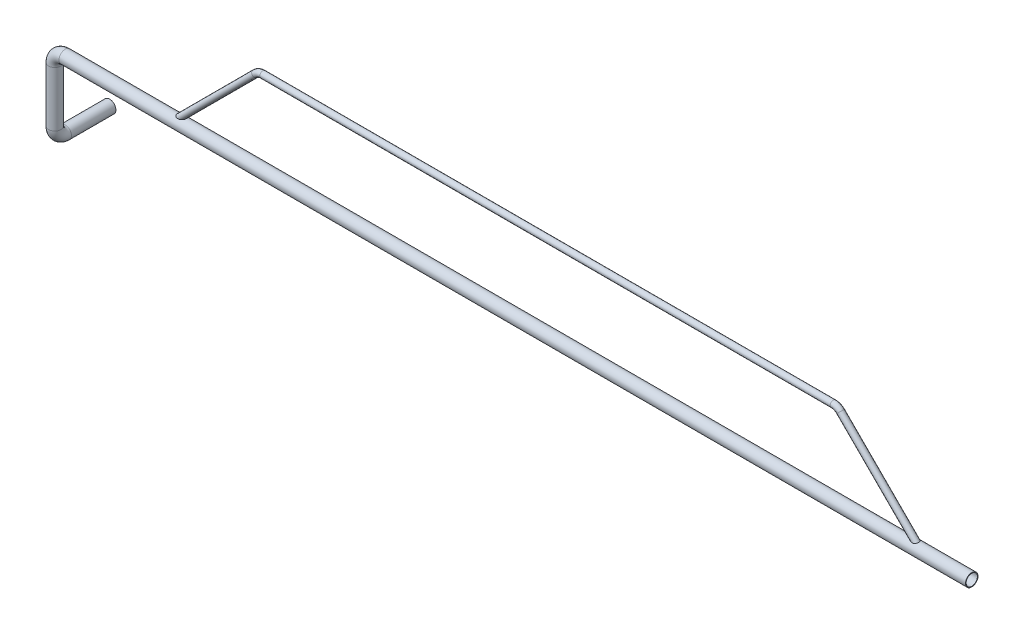
ISO-10303-21;
HEADER;
FILE_DESCRIPTION(('STEP AP214'),'2;1');
FILE_NAME('part.step','',(''),(''),'','','');
FILE_SCHEMA(('AUTOMOTIVE_DESIGN { 1 0 10303 214 1 1 1 1 }'));
ENDSEC;
DATA;
#1=APPLICATION_CONTEXT('core data for automotive mechanical design processes');
#2=APPLICATION_PROTOCOL_DEFINITION('international standard','automotive_design',2000,#1);
#3=PRODUCT_CONTEXT('',#1,'mechanical');
#4=PRODUCT('Part','Part','',(#3));
#5=PRODUCT_RELATED_PRODUCT_CATEGORY('part','',(#4));
#6=PRODUCT_DEFINITION_FORMATION('','',#4);
#7=PRODUCT_DEFINITION_CONTEXT('part definition',#1,'design');
#8=PRODUCT_DEFINITION('design','',#6,#7);
#9=PRODUCT_DEFINITION_SHAPE('','',#8);
#10=(LENGTH_UNIT() NAMED_UNIT(*) SI_UNIT(.MILLI.,.METRE.));
#11=(NAMED_UNIT(*) PLANE_ANGLE_UNIT() SI_UNIT($,.RADIAN.));
#12=(NAMED_UNIT(*) SI_UNIT($,.STERADIAN.) SOLID_ANGLE_UNIT());
#13=UNCERTAINTY_MEASURE_WITH_UNIT(LENGTH_MEASURE(1.E-05),#10,'distance_accuracy_value','');
#14=(GEOMETRIC_REPRESENTATION_CONTEXT(3) GLOBAL_UNCERTAINTY_ASSIGNED_CONTEXT((#13)) GLOBAL_UNIT_ASSIGNED_CONTEXT((#10,
#11,#12)) REPRESENTATION_CONTEXT('',''));
#15=CARTESIAN_POINT('',(0.,0.,0.));
#16=DIRECTION('',(0.,0.,1.));
#17=DIRECTION('',(1.,0.,0.));
#18=AXIS2_PLACEMENT_3D('',#15,#16,#17);
#19=CARTESIAN_POINT('',(-25137.374453509,-8356.20451326409,39090.2492567146));
#20=DIRECTION('',(0.707106781186536,-0.707106781186559,0.));
#21=DIRECTION('',(0.707106781186559,0.707106781186536,0.));
#22=AXIS2_PLACEMENT_3D('',#19,#20,#21);
#23=PLANE('',#22);
#24=CARTESIAN_POINT('',(-25137.374453509,-8356.20451326409,39090.2492567146));
#25=DIRECTION('',(0.707106781186536,-0.707106781186559,0.));
#26=DIRECTION('',(0.707106781186559,0.707106781186536,0.));
#27=AXIS2_PLACEMENT_3D('',#24,#25,#26);
#28=CIRCLE('',#27,12.0000000000006);
#29=CARTESIAN_POINT('',(-25128.8891721347,-8347.71923188985,39090.2492567146));
#30=VERTEX_POINT('',#29);
#31=EDGE_CURVE('E96',#30,#30,#28,.T.);
#32=ORIENTED_EDGE('',*,*,#31,.F.);
#33=EDGE_LOOP('',(#32));
#34=FACE_BOUND('',#33,.T.);
#35=CARTESIAN_POINT('',(-25137.374453509,-8356.20451326409,39090.2492567146));
#36=DIRECTION('',(0.707106781186536,-0.707106781186559,0.));
#37=DIRECTION('',(0.707106781186559,0.707106781186536,0.));
#38=AXIS2_PLACEMENT_3D('',#35,#36,#37);
#39=CIRCLE('',#38,15.0000000000006);
#40=CARTESIAN_POINT('',(-25126.7678517912,-8345.59791154629,39090.2492567146));
#41=VERTEX_POINT('',#40);
#42=EDGE_CURVE('E89',#41,#41,#39,.T.);
#43=ORIENTED_EDGE('',*,*,#42,.T.);
#44=EDGE_LOOP('',(#43));
#45=FACE_BOUND('',#44,.T.);
#46=ADVANCED_FACE('F67',(#34,#45),#23,.T.);
#47=CARTESIAN_POINT('',(-28718.197596503,-8356.20451326411,39090.2492567146));
#48=DIRECTION('',(0.707106781186553,0.707106781186543,0.));
#49=DIRECTION('',(-0.707106781186543,0.707106781186553,0.));
#50=AXIS2_PLACEMENT_3D('',#47,#48,#49);
#51=PLANE('',#50);
#52=CARTESIAN_POINT('',(-28718.197596503,-8356.20451326411,39090.2492567146));
#53=DIRECTION('',(0.707106781186553,0.707106781186543,0.));
#54=DIRECTION('',(-0.707106781186543,0.707106781186553,0.));
#55=AXIS2_PLACEMENT_3D('',#52,#53,#54);
#56=CIRCLE('',#55,12.0000000000006);
#57=CARTESIAN_POINT('',(-28726.6828778773,-8347.71923188987,39090.2492567146));
#58=VERTEX_POINT('',#57);
#59=EDGE_CURVE('E92',#58,#58,#56,.T.);
#60=ORIENTED_EDGE('',*,*,#59,.T.);
#61=EDGE_LOOP('',(#60));
#62=FACE_BOUND('',#61,.T.);
#63=CARTESIAN_POINT('',(-28718.197596503,-8356.20451326411,39090.2492567146));
#64=DIRECTION('',(0.707106781186553,0.707106781186543,0.));
#65=DIRECTION('',(-0.707106781186543,0.707106781186553,0.));
#66=AXIS2_PLACEMENT_3D('',#63,#64,#65);
#67=CIRCLE('',#66,15.0000000000006);
#68=CARTESIAN_POINT('',(-28728.8041982208,-8345.59791154631,39090.2492567146));
#69=VERTEX_POINT('',#68);
#70=EDGE_CURVE('E12',#69,#69,#67,.T.);
#71=ORIENTED_EDGE('',*,*,#70,.F.);
#72=EDGE_LOOP('',(#71));
#73=FACE_BOUND('',#72,.T.);
#74=ADVANCED_FACE('F122',(#62,#73),#51,.F.);
#75=CARTESIAN_POINT('',(-25137.374453509,-8356.20451326409,39090.2492567146));
#76=DIRECTION('',(-0.707106781186546,0.707106781186549,0.));
#77=DIRECTION('',(-0.707106781186549,-0.707106781186546,0.));
#78=AXIS2_PLACEMENT_3D('',#75,#76,#77);
#79=CYLINDRICAL_SURFACE('',#78,15.0000000000006);
#80=CARTESIAN_POINT('',(-25522.7297925683,-7970.84917420477,39090.2492567146));
#81=DIRECTION('',(0.707106781186536,-0.707106781186559,0.));
#82=DIRECTION('',(0.707106781186559,0.707106781186536,0.));
#83=AXIS2_PLACEMENT_3D('',#80,#81,#82);
#84=CIRCLE('',#83,15.0000000000006);
#85=CARTESIAN_POINT('',(-25512.1231908505,-7960.24257248697,39090.2492567146));
#86=VERTEX_POINT('',#85);
#87=EDGE_CURVE('E86',#86,#86,#84,.T.);
#88=ORIENTED_EDGE('',*,*,#87,.T.);
#89=EDGE_LOOP('',(#88));
#90=FACE_BOUND('',#89,.T.);
#91=ORIENTED_EDGE('',*,*,#42,.F.);
#92=EDGE_LOOP('',(#91));
#93=FACE_BOUND('',#92,.T.);
#94=ADVANCED_FACE('F126',(#90,#93),#79,.T.);
#95=CARTESIAN_POINT('',(-25558.0851316276,-8006.2045132641,39090.2492567146));
#96=DIRECTION('',(0.,0.,1.));
#97=DIRECTION('',(1.,0.,0.));
#98=AXIS2_PLACEMENT_3D('',#95,#96,#97);
#99=TOROIDAL_SURFACE('',#98,50.0000000000049,15.0000000000006);
#100=CARTESIAN_POINT('',(-25558.0851316276,-7956.2045132641,39090.2492567146));
#101=DIRECTION('',(1.,0.,0.));
#102=DIRECTION('',(0.,1.,0.));
#103=AXIS2_PLACEMENT_3D('',#100,#101,#102);
#104=CIRCLE('',#103,15.0000000000006);
#105=CARTESIAN_POINT('',(-25558.0851316276,-7941.2045132641,39090.2492567146));
#106=VERTEX_POINT('',#105);
#107=EDGE_CURVE('E81',#106,#106,#104,.T.);
#108=CARTESIAN_POINT('',(-25558.0851316276,-8006.2045132641,39090.2492567146));
#109=DIRECTION('',(0.,0.,1.));
#110=DIRECTION('',(1.,0.,0.));
#111=AXIS2_PLACEMENT_3D('',#108,#109,#110);
#112=CIRCLE('',#111,65.0000000000055);
#113=EDGE_CURVE('',#86,#106,#112,.T.);
#114=ORIENTED_EDGE('',*,*,#87,.F.);
#115=ORIENTED_EDGE('',*,*,#107,.T.);
#116=ORIENTED_EDGE('',*,*,#113,.T.);
#117=ORIENTED_EDGE('',*,*,#113,.F.);
#118=EDGE_LOOP('',(#114,#116,#115,#117));
#119=FACE_BOUND('',#118,.T.);
#120=ADVANCED_FACE('F128',(#119),#99,.T.);
#121=CARTESIAN_POINT('',(-25558.0851316276,-7956.2045132641,39090.2492567146));
#122=DIRECTION('',(-1.,0.,0.));
#123=DIRECTION('',(0.,0.,1.));
#124=AXIS2_PLACEMENT_3D('',#121,#122,#123);
#125=CYLINDRICAL_SURFACE('',#124,15.0000000000006);
#126=CARTESIAN_POINT('',(-28297.4869183844,-7956.2045132641,39090.2492567146));
#127=DIRECTION('',(1.,0.,0.));
#128=DIRECTION('',(0.,1.,0.));
#129=AXIS2_PLACEMENT_3D('',#126,#127,#128);
#130=CIRCLE('',#129,15.0000000000006);
#131=CARTESIAN_POINT('',(-28297.4869183844,-7941.2045132641,39090.2492567146));
#132=VERTEX_POINT('',#131);
#133=EDGE_CURVE('E77',#132,#132,#130,.T.);
#134=ORIENTED_EDGE('',*,*,#133,.T.);
#135=EDGE_LOOP('',(#134));
#136=FACE_BOUND('',#135,.T.);
#137=ORIENTED_EDGE('',*,*,#107,.F.);
#138=EDGE_LOOP('',(#137));
#139=FACE_BOUND('',#138,.T.);
#140=ADVANCED_FACE('F135',(#136,#139),#125,.T.);
#141=CARTESIAN_POINT('',(-28297.4869183844,-8006.20451326411,39090.2492567146));
#142=DIRECTION('',(0.,0.,1.));
#143=DIRECTION('',(1.,0.,0.));
#144=AXIS2_PLACEMENT_3D('',#141,#142,#143);
#145=TOROIDAL_SURFACE('',#144,50.0000000000078,15.0000000000006);
#146=CARTESIAN_POINT('',(-28332.8422574441,-7970.84917420353,39090.2492567146));
#147=DIRECTION('',(0.707106781186553,0.707106781186543,0.));
#148=DIRECTION('',(-0.707106781186543,0.707106781186553,0.));
#149=AXIS2_PLACEMENT_3D('',#146,#147,#148);
#150=CIRCLE('',#149,15.0000000000006);
#151=CARTESIAN_POINT('',(-28343.4488591609,-7960.24257248641,39090.2492567146));
#152=VERTEX_POINT('',#151);
#153=EDGE_CURVE('E73',#152,#152,#150,.T.);
#154=CARTESIAN_POINT('',(-28297.4869183844,-8006.20451326411,39090.2492567146));
#155=DIRECTION('',(0.,0.,1.));
#156=DIRECTION('',(1.,0.,0.));
#157=AXIS2_PLACEMENT_3D('',#154,#155,#156);
#158=CIRCLE('',#157,65.0000000000084);
#159=EDGE_CURVE('',#132,#152,#158,.T.);
#160=ORIENTED_EDGE('',*,*,#133,.F.);
#161=ORIENTED_EDGE('',*,*,#153,.T.);
#162=ORIENTED_EDGE('',*,*,#159,.T.);
#163=ORIENTED_EDGE('',*,*,#159,.F.);
#164=EDGE_LOOP('',(#160,#162,#161,#163));
#165=FACE_BOUND('',#164,.T.);
#166=ADVANCED_FACE('F141',(#165),#145,.T.);
#167=CARTESIAN_POINT('',(-28332.8422574437,-7970.84917420478,39090.2492567146));
#168=DIRECTION('',(-0.707106781186543,-0.707106781186552,0.));
#169=DIRECTION('',(0.707106781186552,-0.707106781186543,0.));
#170=AXIS2_PLACEMENT_3D('',#167,#168,#169);
#171=CYLINDRICAL_SURFACE('',#170,15.0000000000006);
#172=ORIENTED_EDGE('',*,*,#70,.T.);
#173=EDGE_LOOP('',(#172));
#174=FACE_BOUND('',#173,.T.);
#175=ORIENTED_EDGE('',*,*,#153,.F.);
#176=EDGE_LOOP('',(#175));
#177=FACE_BOUND('',#176,.T.);
#178=ADVANCED_FACE('F116',(#174,#177),#171,.T.);
#179=CARTESIAN_POINT('',(-25137.374453509,-8356.20451326409,39090.2492567146));
#180=DIRECTION('',(-0.707106781186546,0.707106781186549,0.));
#181=DIRECTION('',(-0.707106781186549,-0.707106781186546,0.));
#182=AXIS2_PLACEMENT_3D('',#179,#180,#181);
#183=CYLINDRICAL_SURFACE('',#182,12.0000000000006);
#184=CARTESIAN_POINT('',(-25522.7297925683,-7970.84917420477,39090.2492567146));
#185=DIRECTION('',(-0.707106781186546,0.707106781186549,0.));
#186=DIRECTION('',(-0.707106781186549,-0.707106781186546,0.));
#187=AXIS2_PLACEMENT_3D('',#184,#185,#186);
#188=CIRCLE('',#187,12.0000000000006);
#189=CARTESIAN_POINT('',(-25514.244511194,-7962.36389283053,39090.2492567146));
#190=VERTEX_POINT('',#189);
#191=EDGE_CURVE('E99',#190,#190,#188,.F.);
#192=ORIENTED_EDGE('',*,*,#191,.F.);
#193=EDGE_LOOP('',(#192));
#194=FACE_BOUND('',#193,.T.);
#195=ORIENTED_EDGE('',*,*,#31,.T.);
#196=EDGE_LOOP('',(#195));
#197=FACE_BOUND('',#196,.T.);
#198=ADVANCED_FACE('F113',(#194,#197),#183,.F.);
#199=CARTESIAN_POINT('',(-25558.0851316276,-8006.2045132641,39090.2492567146));
#200=DIRECTION('',(0.,0.,1.));
#201=DIRECTION('',(1.,0.,0.));
#202=AXIS2_PLACEMENT_3D('',#199,#200,#201);
#203=TOROIDAL_SURFACE('',#202,50.0000000000049,12.0000000000006);
#204=CARTESIAN_POINT('',(-25558.0851316276,-7956.2045132641,39090.2492567146));
#205=DIRECTION('',(1.,1.01413152110782E-13,0.));
#206=DIRECTION('',(-1.01413152110782E-13,1.,0.));
#207=AXIS2_PLACEMENT_3D('',#204,#205,#206);
#208=CIRCLE('',#207,12.0000000000006);
#209=CARTESIAN_POINT('',(-25558.0851316276,-7944.2045132641,39090.2492567146));
#210=VERTEX_POINT('',#209);
#211=EDGE_CURVE('E105',#210,#210,#208,.T.);
#212=CARTESIAN_POINT('',(-25558.0851316276,-8006.2045132641,39090.2492567146));
#213=DIRECTION('',(0.,0.,1.));
#214=DIRECTION('',(1.,0.,0.));
#215=AXIS2_PLACEMENT_3D('',#212,#213,#214);
#216=CIRCLE('',#215,62.0000000000055);
#217=EDGE_CURVE('',#190,#210,#216,.T.);
#218=ORIENTED_EDGE('',*,*,#191,.T.);
#219=ORIENTED_EDGE('',*,*,#211,.F.);
#220=ORIENTED_EDGE('',*,*,#217,.T.);
#221=ORIENTED_EDGE('',*,*,#217,.F.);
#222=EDGE_LOOP('',(#218,#220,#219,#221));
#223=FACE_BOUND('',#222,.T.);
#224=ADVANCED_FACE('F111',(#223),#203,.F.);
#225=CARTESIAN_POINT('',(-25558.0851316276,-7956.2045132641,39090.2492567146));
#226=DIRECTION('',(-1.,0.,0.));
#227=DIRECTION('',(0.,0.,1.));
#228=AXIS2_PLACEMENT_3D('',#225,#226,#227);
#229=CYLINDRICAL_SURFACE('',#228,12.0000000000006);
#230=CARTESIAN_POINT('',(-28297.4869183844,-7956.2045132641,39090.2492567146));
#231=DIRECTION('',(-1.,0.,0.));
#232=DIRECTION('',(0.,0.,1.));
#233=AXIS2_PLACEMENT_3D('',#230,#231,#232);
#234=CIRCLE('',#233,12.0000000000006);
#235=CARTESIAN_POINT('',(-28297.4869183844,-7944.2045132641,39090.2492567146));
#236=VERTEX_POINT('',#235);
#237=EDGE_CURVE('E102',#236,#236,#234,.F.);
#238=ORIENTED_EDGE('',*,*,#237,.F.);
#239=EDGE_LOOP('',(#238));
#240=FACE_BOUND('',#239,.T.);
#241=ORIENTED_EDGE('',*,*,#211,.T.);
#242=EDGE_LOOP('',(#241));
#243=FACE_BOUND('',#242,.T.);
#244=ADVANCED_FACE('F187',(#240,#243),#229,.F.);
#245=CARTESIAN_POINT('',(-28297.4869183844,-8006.20451326411,39090.2492567146));
#246=DIRECTION('',(0.,0.,1.));
#247=DIRECTION('',(1.,0.,0.));
#248=AXIS2_PLACEMENT_3D('',#245,#246,#247);
#249=TOROIDAL_SURFACE('',#248,50.0000000000078,12.0000000000006);
#250=CARTESIAN_POINT('',(-28332.8422574433,-7970.84917420434,39090.2492567146));
#251=DIRECTION('',(-0.707106781186543,-0.707106781186552,0.));
#252=DIRECTION('',(0.707106781186552,-0.707106781186543,0.));
#253=AXIS2_PLACEMENT_3D('',#250,#251,#252);
#254=CIRCLE('',#253,12.0000000000006);
#255=CARTESIAN_POINT('',(-28341.3275388174,-7962.36389282999,39090.2492567146));
#256=VERTEX_POINT('',#255);
#257=EDGE_CURVE('E95',#256,#256,#254,.F.);
#258=CARTESIAN_POINT('',(-28297.4869183844,-8006.20451326411,39090.2492567146));
#259=DIRECTION('',(0.,0.,1.));
#260=DIRECTION('',(1.,0.,0.));
#261=AXIS2_PLACEMENT_3D('',#258,#259,#260);
#262=CIRCLE('',#261,62.0000000000084);
#263=EDGE_CURVE('',#236,#256,#262,.T.);
#264=ORIENTED_EDGE('',*,*,#237,.T.);
#265=ORIENTED_EDGE('',*,*,#257,.F.);
#266=ORIENTED_EDGE('',*,*,#263,.T.);
#267=ORIENTED_EDGE('',*,*,#263,.F.);
#268=EDGE_LOOP('',(#264,#266,#265,#267));
#269=FACE_BOUND('',#268,.T.);
#270=ADVANCED_FACE('F198',(#269),#249,.F.);
#271=CARTESIAN_POINT('',(-28332.8422574437,-7970.84917420478,39090.2492567146));
#272=DIRECTION('',(-0.707106781186543,-0.707106781186552,0.));
#273=DIRECTION('',(0.707106781186552,-0.707106781186543,0.));
#274=AXIS2_PLACEMENT_3D('',#271,#272,#273);
#275=CYLINDRICAL_SURFACE('',#274,12.0000000000006);
#276=ORIENTED_EDGE('',*,*,#59,.F.);
#277=EDGE_LOOP('',(#276));
#278=FACE_BOUND('',#277,.T.);
#279=ORIENTED_EDGE('',*,*,#257,.T.);
#280=EDGE_LOOP('',(#279));
#281=FACE_BOUND('',#280,.T.);
#282=ADVANCED_FACE('F123',(#278,#281),#275,.F.);
#283=CLOSED_SHELL('',(#46,#74,#94,#120,#140,#166,#178,#198,#224,#244,#270,#282));
#284=MANIFOLD_SOLID_BREP('B2',#283);
#285=CARTESIAN_POINT('',(-24893.0061834818,-8356.2045132641,39090.2492567146));
#286=DIRECTION('',(1.,0.,0.));
#287=DIRECTION('',(0.,-1.,0.));
#288=AXIS2_PLACEMENT_3D('',#285,#286,#287);
#289=PLANE('',#288);
#290=CARTESIAN_POINT('',(-24893.0061834818,-8356.2045132641,39090.2492567146));
#291=DIRECTION('',(1.,0.,0.));
#292=DIRECTION('',(0.,1.,0.));
#293=AXIS2_PLACEMENT_3D('',#290,#291,#292);
#294=CIRCLE('',#293,27.0000000000011);
#295=CARTESIAN_POINT('',(-24893.0061834818,-8329.2045132641,39090.2492567146));
#296=VERTEX_POINT('',#295);
#297=EDGE_CURVE('E302',#296,#296,#294,.T.);
#298=ORIENTED_EDGE('',*,*,#297,.F.);
#299=EDGE_LOOP('',(#298));
#300=FACE_BOUND('',#299,.T.);
#301=CARTESIAN_POINT('',(-24893.0061834818,-8356.2045132641,39090.2492567146));
#302=DIRECTION('',(1.,0.,0.));
#303=DIRECTION('',(0.,-1.,0.));
#304=AXIS2_PLACEMENT_3D('',#301,#302,#303);
#305=CIRCLE('',#304,30.0000000000011);
#306=CARTESIAN_POINT('',(-24893.0061834818,-8386.20451326411,39090.2492567146));
#307=VERTEX_POINT('',#306);
#308=EDGE_CURVE('E295',#307,#307,#305,.T.);
#309=ORIENTED_EDGE('',*,*,#308,.T.);
#310=EDGE_LOOP('',(#309));
#311=FACE_BOUND('',#310,.T.);
#312=ADVANCED_FACE('F273',(#300,#311),#289,.T.);
#313=CARTESIAN_POINT('',(-29296.5546832918,-8720.51863341394,38826.8901960568));
#314=DIRECTION('',(0.,0.,1.));
#315=DIRECTION('',(1.,0.,0.));
#316=AXIS2_PLACEMENT_3D('',#313,#314,#315);
#317=PLANE('',#316);
#318=CARTESIAN_POINT('',(-29296.5546832918,-8720.51863341394,38826.8901960568));
#319=DIRECTION('',(0.,0.,1.));
#320=DIRECTION('',(1.,0.,0.));
#321=AXIS2_PLACEMENT_3D('',#318,#319,#320);
#322=CIRCLE('',#321,27.0000000000011);
#323=CARTESIAN_POINT('',(-29269.5546832918,-8720.51863341394,38826.8901960568));
#324=VERTEX_POINT('',#323);
#325=EDGE_CURVE('E298',#324,#324,#322,.T.);
#326=ORIENTED_EDGE('',*,*,#325,.T.);
#327=EDGE_LOOP('',(#326));
#328=FACE_BOUND('',#327,.T.);
#329=CARTESIAN_POINT('',(-29296.5546832918,-8720.51863341394,38826.8901960568));
#330=DIRECTION('',(0.,0.,1.));
#331=DIRECTION('',(1.,0.,0.));
#332=AXIS2_PLACEMENT_3D('',#329,#330,#331);
#333=CIRCLE('',#332,30.0000000000011);
#334=CARTESIAN_POINT('',(-29266.5546832918,-8720.51863341394,38826.8901960568));
#335=VERTEX_POINT('',#334);
#336=EDGE_CURVE('E66',#335,#335,#333,.T.);
#337=ORIENTED_EDGE('',*,*,#336,.F.);
#338=EDGE_LOOP('',(#337));
#339=FACE_BOUND('',#338,.T.);
#340=ADVANCED_FACE('F328',(#328,#339),#317,.F.);
#341=CARTESIAN_POINT('',(-24893.0061834818,-8356.2045132641,39090.2492567146));
#342=DIRECTION('',(-1.,0.,0.));
#343=DIRECTION('',(0.,0.,1.));
#344=AXIS2_PLACEMENT_3D('',#341,#342,#343);
#345=CYLINDRICAL_SURFACE('',#344,30.0000000000011);
#346=CARTESIAN_POINT('',(-29246.5546832918,-8356.2045132641,39090.2492567146));
#347=DIRECTION('',(1.,0.,0.));
#348=DIRECTION('',(0.,-1.,0.));
#349=AXIS2_PLACEMENT_3D('',#346,#347,#348);
#350=CIRCLE('',#349,30.0000000000011);
#351=CARTESIAN_POINT('',(-29246.5546832918,-8326.2045132641,39090.2492567146));
#352=VERTEX_POINT('',#351);
#353=EDGE_CURVE('E292',#352,#352,#350,.T.);
#354=ORIENTED_EDGE('',*,*,#353,.T.);
#355=EDGE_LOOP('',(#354));
#356=FACE_BOUND('',#355,.T.);
#357=ORIENTED_EDGE('',*,*,#308,.F.);
#358=EDGE_LOOP('',(#357));
#359=FACE_BOUND('',#358,.T.);
#360=ADVANCED_FACE('F332',(#356,#359),#345,.T.);
#361=CARTESIAN_POINT('',(-29246.5546832918,-8406.2045132641,39090.2492567146));
#362=DIRECTION('',(0.,0.,1.));
#363=DIRECTION('',(1.,0.,0.));
#364=AXIS2_PLACEMENT_3D('',#361,#362,#363);
#365=TOROIDAL_SURFACE('',#364,50.0000000000007,30.0000000000011);
#366=CARTESIAN_POINT('',(-29296.5546832918,-8406.2045132641,39090.2492567146));
#367=DIRECTION('',(0.,1.,0.));
#368=DIRECTION('',(1.,0.,0.));
#369=AXIS2_PLACEMENT_3D('',#366,#367,#368);
#370=CIRCLE('',#369,30.0000000000011);
#371=CARTESIAN_POINT('',(-29326.5546832918,-8406.2045132641,39090.2492567146));
#372=VERTEX_POINT('',#371);
#373=EDGE_CURVE('E287',#372,#372,#370,.T.);
#374=CARTESIAN_POINT('',(-29246.5546832918,-8406.2045132641,39090.2492567146));
#375=DIRECTION('',(0.,0.,1.));
#376=DIRECTION('',(1.,0.,0.));
#377=AXIS2_PLACEMENT_3D('',#374,#375,#376);
#378=CIRCLE('',#377,80.0000000000018);
#379=EDGE_CURVE('',#352,#372,#378,.T.);
#380=ORIENTED_EDGE('',*,*,#353,.F.);
#381=ORIENTED_EDGE('',*,*,#373,.T.);
#382=ORIENTED_EDGE('',*,*,#379,.T.);
#383=ORIENTED_EDGE('',*,*,#379,.F.);
#384=EDGE_LOOP('',(#380,#382,#381,#383));
#385=FACE_BOUND('',#384,.T.);
#386=ADVANCED_FACE('F334',(#385),#365,.T.);
#387=CARTESIAN_POINT('',(-29296.5546832918,-8406.2045132641,39090.2492567146));
#388=DIRECTION('',(0.,-1.,0.));
#389=DIRECTION('',(0.,0.,-1.));
#390=AXIS2_PLACEMENT_3D('',#387,#388,#389);
#391=CYLINDRICAL_SURFACE('',#390,30.0000000000011);
#392=CARTESIAN_POINT('',(-29296.5546832918,-8670.51863341394,39090.2492567146));
#393=DIRECTION('',(0.,1.,0.));
#394=DIRECTION('',(1.,0.,0.));
#395=AXIS2_PLACEMENT_3D('',#392,#393,#394);
#396=CIRCLE('',#395,30.0000000000011);
#397=CARTESIAN_POINT('',(-29296.5546832918,-8670.51863341394,39120.2492567146));
#398=VERTEX_POINT('',#397);
#399=EDGE_CURVE('E283',#398,#398,#396,.T.);
#400=ORIENTED_EDGE('',*,*,#399,.T.);
#401=EDGE_LOOP('',(#400));
#402=FACE_BOUND('',#401,.T.);
#403=ORIENTED_EDGE('',*,*,#373,.F.);
#404=EDGE_LOOP('',(#403));
#405=FACE_BOUND('',#404,.T.);
#406=ADVANCED_FACE('F341',(#402,#405),#391,.T.);
#407=CARTESIAN_POINT('',(-29296.5546832918,-8670.51863341394,39040.2492567146));
#408=DIRECTION('',(1.,0.,0.));
#409=DIRECTION('',(0.,0.,-1.));
#410=AXIS2_PLACEMENT_3D('',#407,#408,#409);
#411=TOROIDAL_SURFACE('',#410,49.9999999999972,30.0000000000011);
#412=CARTESIAN_POINT('',(-29296.5546832944,-8720.51863341426,39040.2492567126));
#413=DIRECTION('',(0.,0.,1.));
#414=DIRECTION('',(1.,0.,0.));
#415=AXIS2_PLACEMENT_3D('',#412,#413,#414);
#416=CIRCLE('',#415,30.0000000000011);
#417=CARTESIAN_POINT('',(-29296.554683296,-8750.51863341394,39040.2492567113));
#418=VERTEX_POINT('',#417);
#419=EDGE_CURVE('E279',#418,#418,#416,.T.);
#420=CARTESIAN_POINT('',(-29296.5546832918,-8670.51863341394,39040.2492567146));
#421=DIRECTION('',(1.,0.,0.));
#422=DIRECTION('',(0.,0.,-1.));
#423=AXIS2_PLACEMENT_3D('',#420,#421,#422);
#424=CIRCLE('',#423,79.9999999999983);
#425=EDGE_CURVE('',#398,#418,#424,.T.);
#426=ORIENTED_EDGE('',*,*,#399,.F.);
#427=ORIENTED_EDGE('',*,*,#419,.T.);
#428=ORIENTED_EDGE('',*,*,#425,.T.);
#429=ORIENTED_EDGE('',*,*,#425,.F.);
#430=EDGE_LOOP('',(#426,#428,#427,#429));
#431=FACE_BOUND('',#430,.T.);
#432=ADVANCED_FACE('F347',(#431),#411,.T.);
#433=CARTESIAN_POINT('',(-29296.5546832918,-8720.51863341394,39040.2492567146));
#434=DIRECTION('',(0.,0.,-1.));
#435=DIRECTION('',(-1.,0.,0.));
#436=AXIS2_PLACEMENT_3D('',#433,#434,#435);
#437=CYLINDRICAL_SURFACE('',#436,30.0000000000011);
#438=ORIENTED_EDGE('',*,*,#336,.T.);
#439=EDGE_LOOP('',(#438));
#440=FACE_BOUND('',#439,.T.);
#441=ORIENTED_EDGE('',*,*,#419,.F.);
#442=EDGE_LOOP('',(#441));
#443=FACE_BOUND('',#442,.T.);
#444=ADVANCED_FACE('F322',(#440,#443),#437,.T.);
#445=CARTESIAN_POINT('',(-24893.0061834818,-8356.2045132641,39090.2492567146));
#446=DIRECTION('',(-1.,0.,0.));
#447=DIRECTION('',(0.,0.,1.));
#448=AXIS2_PLACEMENT_3D('',#445,#446,#447);
#449=CYLINDRICAL_SURFACE('',#448,27.0000000000011);
#450=CARTESIAN_POINT('',(-29246.5546832918,-8356.2045132641,39090.2492567146));
#451=DIRECTION('',(-1.,0.,0.));
#452=DIRECTION('',(0.,0.,1.));
#453=AXIS2_PLACEMENT_3D('',#450,#451,#452);
#454=CIRCLE('',#453,27.0000000000011);
#455=CARTESIAN_POINT('',(-29246.5546832918,-8329.2045132641,39090.2492567146));
#456=VERTEX_POINT('',#455);
#457=EDGE_CURVE('E305',#456,#456,#454,.F.);
#458=ORIENTED_EDGE('',*,*,#457,.F.);
#459=EDGE_LOOP('',(#458));
#460=FACE_BOUND('',#459,.T.);
#461=ORIENTED_EDGE('',*,*,#297,.T.);
#462=EDGE_LOOP('',(#461));
#463=FACE_BOUND('',#462,.T.);
#464=ADVANCED_FACE('F319',(#460,#463),#449,.F.);
#465=CARTESIAN_POINT('',(-29246.5546832918,-8406.2045132641,39090.2492567146));
#466=DIRECTION('',(0.,0.,1.));
#467=DIRECTION('',(1.,0.,0.));
#468=AXIS2_PLACEMENT_3D('',#465,#466,#467);
#469=TOROIDAL_SURFACE('',#468,50.0000000000007,27.0000000000011);
#470=CARTESIAN_POINT('',(-29296.5546832918,-8406.2045132641,39090.2492567146));
#471=DIRECTION('',(0.,1.,0.));
#472=DIRECTION('',(-1.,0.,0.));
#473=AXIS2_PLACEMENT_3D('',#470,#471,#472);
#474=CIRCLE('',#473,27.0000000000011);
#475=CARTESIAN_POINT('',(-29323.5546832918,-8406.2045132641,39090.2492567146));
#476=VERTEX_POINT('',#475);
#477=EDGE_CURVE('E311',#476,#476,#474,.T.);
#478=CARTESIAN_POINT('',(-29246.5546832918,-8406.2045132641,39090.2492567146));
#479=DIRECTION('',(0.,0.,1.));
#480=DIRECTION('',(1.,0.,0.));
#481=AXIS2_PLACEMENT_3D('',#478,#479,#480);
#482=CIRCLE('',#481,77.0000000000018);
#483=EDGE_CURVE('',#456,#476,#482,.T.);
#484=ORIENTED_EDGE('',*,*,#457,.T.);
#485=ORIENTED_EDGE('',*,*,#477,.F.);
#486=ORIENTED_EDGE('',*,*,#483,.T.);
#487=ORIENTED_EDGE('',*,*,#483,.F.);
#488=EDGE_LOOP('',(#484,#486,#485,#487));
#489=FACE_BOUND('',#488,.T.);
#490=ADVANCED_FACE('F317',(#489),#469,.F.);
#491=CARTESIAN_POINT('',(-29296.5546832918,-8406.2045132641,39090.2492567146));
#492=DIRECTION('',(0.,-1.,0.));
#493=DIRECTION('',(0.,0.,-1.));
#494=AXIS2_PLACEMENT_3D('',#491,#492,#493);
#495=CYLINDRICAL_SURFACE('',#494,27.0000000000011);
#496=CARTESIAN_POINT('',(-29296.5546832918,-8670.51863341394,39090.2492567146));
#497=DIRECTION('',(0.,-1.,0.));
#498=DIRECTION('',(0.,0.,-1.));
#499=AXIS2_PLACEMENT_3D('',#496,#497,#498);
#500=CIRCLE('',#499,27.0000000000011);
#501=CARTESIAN_POINT('',(-29296.5546832918,-8670.51863341395,39117.2492567146));
#502=VERTEX_POINT('',#501);
#503=EDGE_CURVE('E308',#502,#502,#500,.F.);
#504=ORIENTED_EDGE('',*,*,#503,.F.);
#505=EDGE_LOOP('',(#504));
#506=FACE_BOUND('',#505,.T.);
#507=ORIENTED_EDGE('',*,*,#477,.T.);
#508=EDGE_LOOP('',(#507));
#509=FACE_BOUND('',#508,.T.);
#510=ADVANCED_FACE('F393',(#506,#509),#495,.F.);
#511=CARTESIAN_POINT('',(-29296.5546832918,-8670.51863341394,39040.2492567146));
#512=DIRECTION('',(1.,0.,0.));
#513=DIRECTION('',(0.,0.,-1.));
#514=AXIS2_PLACEMENT_3D('',#511,#512,#513);
#515=TOROIDAL_SURFACE('',#514,49.9999999999972,27.0000000000011);
#516=CARTESIAN_POINT('',(-29296.5546832918,-8720.51863341394,39040.2492567126));
#517=DIRECTION('',(0.,0.,-1.));
#518=DIRECTION('',(-1.,0.,0.));
#519=AXIS2_PLACEMENT_3D('',#516,#517,#518);
#520=CIRCLE('',#519,27.0000000000011);
#521=CARTESIAN_POINT('',(-29296.5546832918,-8747.51863341394,39040.2492567115));
#522=VERTEX_POINT('',#521);
#523=EDGE_CURVE('E301',#522,#522,#520,.F.);
#524=CARTESIAN_POINT('',(-29296.5546832918,-8670.51863341394,39040.2492567146));
#525=DIRECTION('',(1.,0.,0.));
#526=DIRECTION('',(0.,0.,-1.));
#527=AXIS2_PLACEMENT_3D('',#524,#525,#526);
#528=CIRCLE('',#527,76.9999999999983);
#529=EDGE_CURVE('',#502,#522,#528,.T.);
#530=ORIENTED_EDGE('',*,*,#503,.T.);
#531=ORIENTED_EDGE('',*,*,#523,.F.);
#532=ORIENTED_EDGE('',*,*,#529,.T.);
#533=ORIENTED_EDGE('',*,*,#529,.F.);
#534=EDGE_LOOP('',(#530,#532,#531,#533));
#535=FACE_BOUND('',#534,.T.);
#536=ADVANCED_FACE('F404',(#535),#515,.F.);
#537=CARTESIAN_POINT('',(-29296.5546832918,-8720.51863341394,39040.2492567146));
#538=DIRECTION('',(0.,0.,-1.));
#539=DIRECTION('',(-1.,0.,0.));
#540=AXIS2_PLACEMENT_3D('',#537,#538,#539);
#541=CYLINDRICAL_SURFACE('',#540,27.0000000000011);
#542=ORIENTED_EDGE('',*,*,#325,.F.);
#543=EDGE_LOOP('',(#542));
#544=FACE_BOUND('',#543,.T.);
#545=ORIENTED_EDGE('',*,*,#523,.T.);
#546=EDGE_LOOP('',(#545));
#547=FACE_BOUND('',#546,.T.);
#548=ADVANCED_FACE('F329',(#544,#547),#541,.F.);
#549=CLOSED_SHELL('',(#312,#340,#360,#386,#406,#432,#444,#464,#490,#510,#536,#548));
#550=MANIFOLD_SOLID_BREP('B7',#549);
#551=ADVANCED_BREP_SHAPE_REPRESENTATION('',(#18,#284,#550),#14);
#552=SHAPE_DEFINITION_REPRESENTATION(#9,#551);
ENDSEC;
END-ISO-10303-21;
